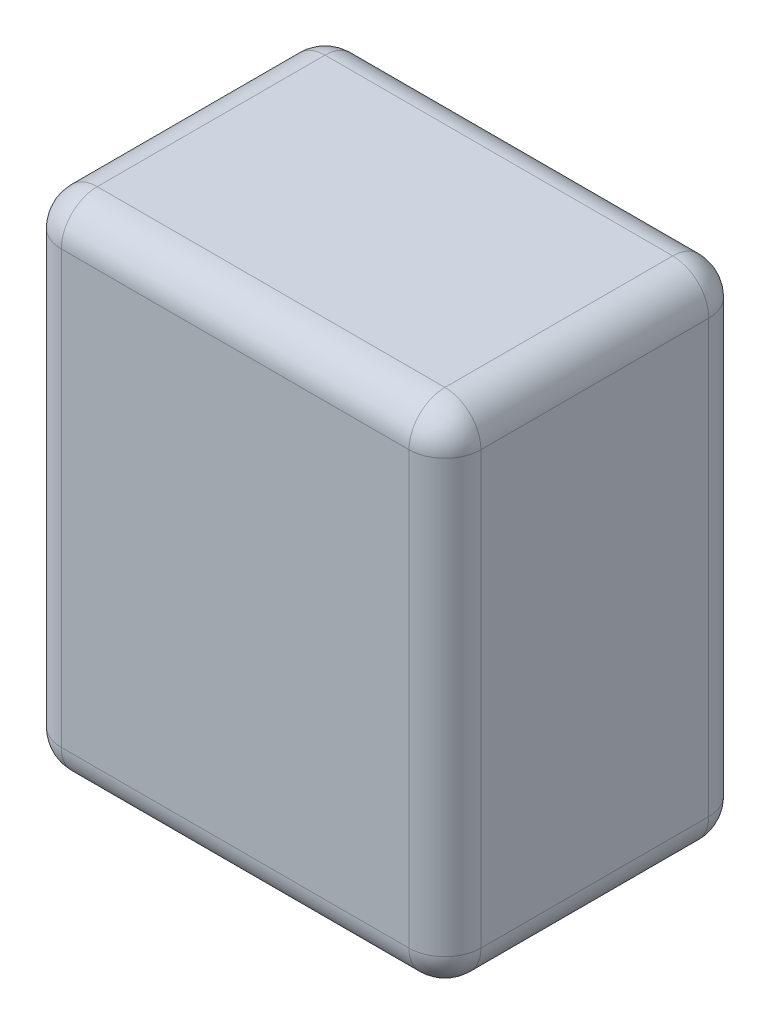
ISO-10303-21;
HEADER;
FILE_DESCRIPTION(('STEP AP214'),'2;1');
FILE_NAME('part.step','',(''),(''),'','','');
FILE_SCHEMA(('AUTOMOTIVE_DESIGN { 1 0 10303 214 1 1 1 1 }'));
ENDSEC;
DATA;
#1=APPLICATION_CONTEXT('core data for automotive mechanical design processes');
#2=APPLICATION_PROTOCOL_DEFINITION('international standard','automotive_design',2000,#1);
#3=PRODUCT_CONTEXT('',#1,'mechanical');
#4=PRODUCT('Part','Part','',(#3));
#5=PRODUCT_RELATED_PRODUCT_CATEGORY('part','',(#4));
#6=PRODUCT_DEFINITION_FORMATION('','',#4);
#7=PRODUCT_DEFINITION_CONTEXT('part definition',#1,'design');
#8=PRODUCT_DEFINITION('design','',#6,#7);
#9=PRODUCT_DEFINITION_SHAPE('','',#8);
#10=(LENGTH_UNIT() NAMED_UNIT(*) SI_UNIT(.MILLI.,.METRE.));
#11=(NAMED_UNIT(*) PLANE_ANGLE_UNIT() SI_UNIT($,.RADIAN.));
#12=(NAMED_UNIT(*) SI_UNIT($,.STERADIAN.) SOLID_ANGLE_UNIT());
#13=UNCERTAINTY_MEASURE_WITH_UNIT(LENGTH_MEASURE(1.E-05),#10,'distance_accuracy_value','');
#14=(GEOMETRIC_REPRESENTATION_CONTEXT(3) GLOBAL_UNCERTAINTY_ASSIGNED_CONTEXT((#13)) GLOBAL_UNIT_ASSIGNED_CONTEXT((#10,
#11,#12)) REPRESENTATION_CONTEXT('',''));
#15=CARTESIAN_POINT('',(0.,0.,0.));
#16=DIRECTION('',(0.,0.,1.));
#17=DIRECTION('',(1.,0.,0.));
#18=AXIS2_PLACEMENT_3D('',#15,#16,#17);
#19=CARTESIAN_POINT('',(17.5,42.,-12.5));
#20=DIRECTION('',(-1.,0.,0.));
#21=DIRECTION('',(0.,0.,1.));
#22=AXIS2_PLACEMENT_3D('',#19,#20,#21);
#23=PLANE('',#22);
#24=DIRECTION('',(0.,-1.,0.));
#25=VECTOR('',#24,1.);
#26=CARTESIAN_POINT('',(17.5,42.,-9.5));
#27=LINE('',#26,#25);
#28=CARTESIAN_POINT('',(17.5,3.,-9.5));
#29=VERTEX_POINT('',#28);
#30=CARTESIAN_POINT('',(17.5,39.,-9.5));
#31=VERTEX_POINT('',#30);
#32=EDGE_CURVE('E139',#29,#31,#27,.F.);
#33=ORIENTED_EDGE('',*,*,#32,.T.);
#34=DIRECTION('',(0.,0.,-1.));
#35=VECTOR('',#34,1.);
#36=CARTESIAN_POINT('',(17.5,39.,12.5));
#37=LINE('',#36,#35);
#38=CARTESIAN_POINT('',(17.5,39.,9.5));
#39=VERTEX_POINT('',#38);
#40=EDGE_CURVE('E185',#31,#39,#37,.F.);
#41=ORIENTED_EDGE('',*,*,#40,.T.);
#42=DIRECTION('',(0.,-1.,0.));
#43=VECTOR('',#42,1.);
#44=CARTESIAN_POINT('',(17.5,42.,9.5));
#45=LINE('',#44,#43);
#46=CARTESIAN_POINT('',(17.5,3.,9.5));
#47=VERTEX_POINT('',#46);
#48=EDGE_CURVE('E180',#39,#47,#45,.T.);
#49=ORIENTED_EDGE('',*,*,#48,.T.);
#50=DIRECTION('',(0.,0.,-1.));
#51=VECTOR('',#50,1.);
#52=CARTESIAN_POINT('',(17.5,3.,-12.5));
#53=LINE('',#52,#51);
#54=EDGE_CURVE('E174',#47,#29,#53,.T.);
#55=ORIENTED_EDGE('',*,*,#54,.T.);
#56=EDGE_LOOP('',(#33,#41,#49,#55));
#57=FACE_BOUND('',#56,.T.);
#58=ADVANCED_FACE('F43',(#57),#23,.F.);
#59=CARTESIAN_POINT('',(-17.5,42.,-12.5));
#60=DIRECTION('',(0.,0.,1.));
#61=DIRECTION('',(1.,0.,0.));
#62=AXIS2_PLACEMENT_3D('',#59,#60,#61);
#63=PLANE('',#62);
#64=DIRECTION('',(0.,-1.,0.));
#65=VECTOR('',#64,1.);
#66=CARTESIAN_POINT('',(-14.5,42.,-12.5));
#67=LINE('',#66,#65);
#68=CARTESIAN_POINT('',(-14.5,3.,-12.5));
#69=VERTEX_POINT('',#68);
#70=CARTESIAN_POINT('',(-14.5,39.,-12.5));
#71=VERTEX_POINT('',#70);
#72=EDGE_CURVE('E164',#69,#71,#67,.F.);
#73=ORIENTED_EDGE('',*,*,#72,.T.);
#74=DIRECTION('',(-1.,0.,0.));
#75=VECTOR('',#74,1.);
#76=CARTESIAN_POINT('',(17.5,39.,-12.5));
#77=LINE('',#76,#75);
#78=CARTESIAN_POINT('',(14.5,39.,-12.5));
#79=VERTEX_POINT('',#78);
#80=EDGE_CURVE('E168',#71,#79,#77,.F.);
#81=ORIENTED_EDGE('',*,*,#80,.T.);
#82=DIRECTION('',(0.,-1.,0.));
#83=VECTOR('',#82,1.);
#84=CARTESIAN_POINT('',(14.5,42.,-12.5));
#85=LINE('',#84,#83);
#86=CARTESIAN_POINT('',(14.5,3.,-12.5));
#87=VERTEX_POINT('',#86);
#88=EDGE_CURVE('E137',#79,#87,#85,.T.);
#89=ORIENTED_EDGE('',*,*,#88,.T.);
#90=DIRECTION('',(-1.,0.,0.));
#91=VECTOR('',#90,1.);
#92=CARTESIAN_POINT('',(-17.5,3.,-12.5));
#93=LINE('',#92,#91);
#94=EDGE_CURVE('E157',#87,#69,#93,.T.);
#95=ORIENTED_EDGE('',*,*,#94,.T.);
#96=EDGE_LOOP('',(#73,#81,#89,#95));
#97=FACE_BOUND('',#96,.T.);
#98=ADVANCED_FACE('F166',(#97),#63,.F.);
#99=CARTESIAN_POINT('',(-17.5,42.,-12.5));
#100=DIRECTION('',(1.,0.,0.));
#101=DIRECTION('',(0.,0.,-1.));
#102=AXIS2_PLACEMENT_3D('',#99,#100,#101);
#103=PLANE('',#102);
#104=DIRECTION('',(0.,-1.,0.));
#105=VECTOR('',#104,1.);
#106=CARTESIAN_POINT('',(-17.5,42.,9.5));
#107=LINE('',#106,#105);
#108=CARTESIAN_POINT('',(-17.5,3.,9.5));
#109=VERTEX_POINT('',#108);
#110=CARTESIAN_POINT('',(-17.5,39.,9.5));
#111=VERTEX_POINT('',#110);
#112=EDGE_CURVE('E191',#109,#111,#107,.F.);
#113=ORIENTED_EDGE('',*,*,#112,.T.);
#114=DIRECTION('',(0.,0.,1.));
#115=VECTOR('',#114,1.);
#116=CARTESIAN_POINT('',(-17.5,39.,-12.5));
#117=LINE('',#116,#115);
#118=CARTESIAN_POINT('',(-17.5,39.,-9.5));
#119=VERTEX_POINT('',#118);
#120=EDGE_CURVE('E198',#111,#119,#117,.F.);
#121=ORIENTED_EDGE('',*,*,#120,.T.);
#122=DIRECTION('',(0.,-1.,0.));
#123=VECTOR('',#122,1.);
#124=CARTESIAN_POINT('',(-17.5,42.,-9.5));
#125=LINE('',#124,#123);
#126=CARTESIAN_POINT('',(-17.5,3.,-9.5));
#127=VERTEX_POINT('',#126);
#128=EDGE_CURVE('E194',#119,#127,#125,.T.);
#129=ORIENTED_EDGE('',*,*,#128,.T.);
#130=DIRECTION('',(0.,0.,1.));
#131=VECTOR('',#130,1.);
#132=CARTESIAN_POINT('',(-17.5,3.,-12.5));
#133=LINE('',#132,#131);
#134=EDGE_CURVE('E188',#127,#109,#133,.T.);
#135=ORIENTED_EDGE('',*,*,#134,.T.);
#136=EDGE_LOOP('',(#113,#121,#129,#135));
#137=FACE_BOUND('',#136,.T.);
#138=ADVANCED_FACE('F337',(#137),#103,.F.);
#139=CARTESIAN_POINT('',(-17.5,42.,12.5));
#140=DIRECTION('',(0.,0.,-1.));
#141=DIRECTION('',(-1.,0.,0.));
#142=AXIS2_PLACEMENT_3D('',#139,#140,#141);
#143=PLANE('',#142);
#144=DIRECTION('',(0.,-1.,0.));
#145=VECTOR('',#144,1.);
#146=CARTESIAN_POINT('',(14.5,42.,12.5));
#147=LINE('',#146,#145);
#148=CARTESIAN_POINT('',(14.5,3.,12.5));
#149=VERTEX_POINT('',#148);
#150=CARTESIAN_POINT('',(14.5,39.,12.5));
#151=VERTEX_POINT('',#150);
#152=EDGE_CURVE('E204',#149,#151,#147,.F.);
#153=ORIENTED_EDGE('',*,*,#152,.T.);
#154=DIRECTION('',(1.,0.,0.));
#155=VECTOR('',#154,1.);
#156=CARTESIAN_POINT('',(-17.5,39.,12.5));
#157=LINE('',#156,#155);
#158=CARTESIAN_POINT('',(-14.5,39.,12.5));
#159=VERTEX_POINT('',#158);
#160=EDGE_CURVE('E211',#151,#159,#157,.F.);
#161=ORIENTED_EDGE('',*,*,#160,.T.);
#162=DIRECTION('',(0.,-1.,0.));
#163=VECTOR('',#162,1.);
#164=CARTESIAN_POINT('',(-14.5,42.,12.5));
#165=LINE('',#164,#163);
#166=CARTESIAN_POINT('',(-14.5,3.,12.5));
#167=VERTEX_POINT('',#166);
#168=EDGE_CURVE('E207',#159,#167,#165,.T.);
#169=ORIENTED_EDGE('',*,*,#168,.T.);
#170=DIRECTION('',(1.,0.,0.));
#171=VECTOR('',#170,1.);
#172=CARTESIAN_POINT('',(-17.5,3.,12.5));
#173=LINE('',#172,#171);
#174=EDGE_CURVE('E201',#167,#149,#173,.T.);
#175=ORIENTED_EDGE('',*,*,#174,.T.);
#176=EDGE_LOOP('',(#153,#161,#169,#175));
#177=FACE_BOUND('',#176,.T.);
#178=ADVANCED_FACE('F347',(#177),#143,.F.);
#179=CARTESIAN_POINT('',(0.,42.,0.));
#180=DIRECTION('',(0.,1.,0.));
#181=DIRECTION('',(0.,0.,1.));
#182=AXIS2_PLACEMENT_3D('',#179,#180,#181);
#183=PLANE('',#182);
#184=DIRECTION('',(0.,0.,1.));
#185=VECTOR('',#184,1.);
#186=CARTESIAN_POINT('',(-14.5,42.,12.5));
#187=LINE('',#186,#185);
#188=CARTESIAN_POINT('',(-14.5,42.,-9.5));
#189=VERTEX_POINT('',#188);
#190=CARTESIAN_POINT('',(-14.5,42.,9.5));
#191=VERTEX_POINT('',#190);
#192=EDGE_CURVE('E220',#189,#191,#187,.T.);
#193=ORIENTED_EDGE('',*,*,#192,.T.);
#194=DIRECTION('',(1.,0.,0.));
#195=VECTOR('',#194,1.);
#196=CARTESIAN_POINT('',(17.5,42.,9.5));
#197=LINE('',#196,#195);
#198=CARTESIAN_POINT('',(14.5,42.,9.5));
#199=VERTEX_POINT('',#198);
#200=EDGE_CURVE('E223',#191,#199,#197,.T.);
#201=ORIENTED_EDGE('',*,*,#200,.T.);
#202=DIRECTION('',(0.,0.,-1.));
#203=VECTOR('',#202,1.);
#204=CARTESIAN_POINT('',(14.5,42.,-12.5));
#205=LINE('',#204,#203);
#206=CARTESIAN_POINT('',(14.5,42.,-9.5));
#207=VERTEX_POINT('',#206);
#208=EDGE_CURVE('E214',#199,#207,#205,.T.);
#209=ORIENTED_EDGE('',*,*,#208,.T.);
#210=DIRECTION('',(-1.,0.,0.));
#211=VECTOR('',#210,1.);
#212=CARTESIAN_POINT('',(-17.5,42.,-9.5));
#213=LINE('',#212,#211);
#214=EDGE_CURVE('E217',#207,#189,#213,.T.);
#215=ORIENTED_EDGE('',*,*,#214,.T.);
#216=EDGE_LOOP('',(#193,#201,#209,#215));
#217=FACE_BOUND('',#216,.T.);
#218=ADVANCED_FACE('F329',(#217),#183,.T.);
#219=CARTESIAN_POINT('',(0.,0.,0.));
#220=DIRECTION('',(0.,1.,0.));
#221=DIRECTION('',(0.,0.,1.));
#222=AXIS2_PLACEMENT_3D('',#219,#220,#221);
#223=PLANE('',#222);
#224=DIRECTION('',(0.,0.,-1.));
#225=VECTOR('',#224,1.);
#226=CARTESIAN_POINT('',(14.5,0.,0.));
#227=LINE('',#226,#225);
#228=CARTESIAN_POINT('',(14.5,0.,-9.5));
#229=VERTEX_POINT('',#228);
#230=CARTESIAN_POINT('',(14.5,0.,9.5));
#231=VERTEX_POINT('',#230);
#232=EDGE_CURVE('E227',#229,#231,#227,.F.);
#233=ORIENTED_EDGE('',*,*,#232,.T.);
#234=DIRECTION('',(1.,0.,0.));
#235=VECTOR('',#234,1.);
#236=CARTESIAN_POINT('',(0.,0.,9.5));
#237=LINE('',#236,#235);
#238=CARTESIAN_POINT('',(-14.5,0.,9.5));
#239=VERTEX_POINT('',#238);
#240=EDGE_CURVE('E11',#231,#239,#237,.F.);
#241=ORIENTED_EDGE('',*,*,#240,.T.);
#242=DIRECTION('',(0.,0.,1.));
#243=VECTOR('',#242,1.);
#244=CARTESIAN_POINT('',(-14.5,0.,0.));
#245=LINE('',#244,#243);
#246=CARTESIAN_POINT('',(-14.5,0.,-9.5));
#247=VERTEX_POINT('',#246);
#248=EDGE_CURVE('E53',#239,#247,#245,.F.);
#249=ORIENTED_EDGE('',*,*,#248,.T.);
#250=DIRECTION('',(-1.,0.,0.));
#251=VECTOR('',#250,1.);
#252=CARTESIAN_POINT('',(0.,0.,-9.5));
#253=LINE('',#252,#251);
#254=EDGE_CURVE('E230',#247,#229,#253,.F.);
#255=ORIENTED_EDGE('',*,*,#254,.T.);
#256=EDGE_LOOP('',(#233,#241,#249,#255));
#257=FACE_BOUND('',#256,.T.);
#258=ADVANCED_FACE('F575',(#257),#223,.F.);
#259=CARTESIAN_POINT('',(-14.5,42.,9.5));
#260=DIRECTION('',(0.,-1.,0.));
#261=DIRECTION('',(0.,0.,-1.));
#262=AXIS2_PLACEMENT_3D('',#259,#260,#261);
#263=CYLINDRICAL_SURFACE('',#262,3.);
#264=CARTESIAN_POINT('',(-14.5,39.,9.5));
#265=DIRECTION('',(0.,1.,0.));
#266=DIRECTION('',(0.,0.,1.));
#267=AXIS2_PLACEMENT_3D('',#264,#265,#266);
#268=CIRCLE('',#267,3.);
#269=EDGE_CURVE('E47',#111,#159,#268,.T.);
#270=ORIENTED_EDGE('',*,*,#269,.F.);
#271=ORIENTED_EDGE('',*,*,#112,.F.);
#272=CARTESIAN_POINT('',(-14.5,3.,9.5));
#273=DIRECTION('',(0.,-1.,0.));
#274=DIRECTION('',(0.,0.,-1.));
#275=AXIS2_PLACEMENT_3D('',#272,#273,#274);
#276=CIRCLE('',#275,3.);
#277=EDGE_CURVE('E305',#167,#109,#276,.T.);
#278=ORIENTED_EDGE('',*,*,#277,.F.);
#279=ORIENTED_EDGE('',*,*,#168,.F.);
#280=EDGE_LOOP('',(#270,#271,#278,#279));
#281=FACE_BOUND('',#280,.T.);
#282=ADVANCED_FACE('F45',(#281),#263,.T.);
#283=CARTESIAN_POINT('',(-14.5,39.,9.5));
#284=DIRECTION('',(0.,0.,1.));
#285=DIRECTION('',(1.,0.,0.));
#286=AXIS2_PLACEMENT_3D('',#283,#284,#285);
#287=SPHERICAL_SURFACE('',#286,3.);
#288=CARTESIAN_POINT('',(-14.5,39.,9.5));
#289=DIRECTION('',(0.,0.,1.));
#290=DIRECTION('',(1.,0.,0.));
#291=AXIS2_PLACEMENT_3D('',#288,#289,#290);
#292=CIRCLE('',#291,3.);
#293=EDGE_CURVE('E298',#111,#191,#292,.F.);
#294=ORIENTED_EDGE('',*,*,#293,.F.);
#295=ORIENTED_EDGE('',*,*,#269,.T.);
#296=CARTESIAN_POINT('',(-14.5,39.,9.5));
#297=DIRECTION('',(-1.,0.,0.));
#298=DIRECTION('',(0.,0.,1.));
#299=AXIS2_PLACEMENT_3D('',#296,#297,#298);
#300=CIRCLE('',#299,3.);
#301=EDGE_CURVE('E302',#191,#159,#300,.F.);
#302=ORIENTED_EDGE('',*,*,#301,.F.);
#303=EDGE_LOOP('',(#294,#295,#302));
#304=FACE_BOUND('',#303,.T.);
#305=ADVANCED_FACE('F317',(#304),#287,.T.);
#306=CARTESIAN_POINT('',(-14.5,3.,9.5));
#307=DIRECTION('',(-1.,0.,0.));
#308=DIRECTION('',(0.,-1.,0.));
#309=AXIS2_PLACEMENT_3D('',#306,#307,#308);
#310=SPHERICAL_SURFACE('',#309,3.);
#311=CARTESIAN_POINT('',(-14.5,3.,9.5));
#312=DIRECTION('',(-1.,0.,0.));
#313=DIRECTION('',(0.,0.,1.));
#314=AXIS2_PLACEMENT_3D('',#311,#312,#313);
#315=CIRCLE('',#314,3.);
#316=EDGE_CURVE('E291',#167,#239,#315,.F.);
#317=ORIENTED_EDGE('',*,*,#316,.F.);
#318=ORIENTED_EDGE('',*,*,#277,.T.);
#319=CARTESIAN_POINT('',(-14.5,3.,9.5));
#320=DIRECTION('',(0.,0.,1.));
#321=DIRECTION('',(1.,0.,0.));
#322=AXIS2_PLACEMENT_3D('',#319,#320,#321);
#323=CIRCLE('',#322,3.);
#324=EDGE_CURVE('E295',#239,#109,#323,.F.);
#325=ORIENTED_EDGE('',*,*,#324,.F.);
#326=EDGE_LOOP('',(#317,#318,#325));
#327=FACE_BOUND('',#326,.T.);
#328=ADVANCED_FACE('F548',(#327),#310,.T.);
#329=CARTESIAN_POINT('',(0.,39.,9.5));
#330=DIRECTION('',(-1.,0.,0.));
#331=DIRECTION('',(0.,0.,1.));
#332=AXIS2_PLACEMENT_3D('',#329,#330,#331);
#333=CYLINDRICAL_SURFACE('',#332,3.);
#334=ORIENTED_EDGE('',*,*,#301,.T.);
#335=ORIENTED_EDGE('',*,*,#160,.F.);
#336=CARTESIAN_POINT('',(14.5,39.,9.5));
#337=DIRECTION('',(1.,0.,0.));
#338=DIRECTION('',(0.,0.,-1.));
#339=AXIS2_PLACEMENT_3D('',#336,#337,#338);
#340=CIRCLE('',#339,3.);
#341=EDGE_CURVE('E283',#199,#151,#340,.T.);
#342=ORIENTED_EDGE('',*,*,#341,.F.);
#343=ORIENTED_EDGE('',*,*,#200,.F.);
#344=EDGE_LOOP('',(#334,#335,#342,#343));
#345=FACE_BOUND('',#344,.T.);
#346=ADVANCED_FACE('F325',(#345),#333,.T.);
#347=CARTESIAN_POINT('',(-14.5,39.,0.));
#348=DIRECTION('',(0.,0.,-1.));
#349=DIRECTION('',(-1.,0.,0.));
#350=AXIS2_PLACEMENT_3D('',#347,#348,#349);
#351=CYLINDRICAL_SURFACE('',#350,3.);
#352=ORIENTED_EDGE('',*,*,#293,.T.);
#353=ORIENTED_EDGE('',*,*,#192,.F.);
#354=CARTESIAN_POINT('',(-14.5,39.,-9.5));
#355=DIRECTION('',(0.,0.,-1.));
#356=DIRECTION('',(-1.,0.,0.));
#357=AXIS2_PLACEMENT_3D('',#354,#355,#356);
#358=CIRCLE('',#357,3.);
#359=EDGE_CURVE('E279',#119,#189,#358,.T.);
#360=ORIENTED_EDGE('',*,*,#359,.F.);
#361=ORIENTED_EDGE('',*,*,#120,.F.);
#362=EDGE_LOOP('',(#352,#353,#360,#361));
#363=FACE_BOUND('',#362,.T.);
#364=ADVANCED_FACE('F334',(#363),#351,.T.);
#365=CARTESIAN_POINT('',(-14.5,42.,-9.5));
#366=DIRECTION('',(0.,-1.,0.));
#367=DIRECTION('',(0.,0.,-1.));
#368=AXIS2_PLACEMENT_3D('',#365,#366,#367);
#369=CYLINDRICAL_SURFACE('',#368,3.);
#370=CARTESIAN_POINT('',(-14.5,3.,-9.5));
#371=DIRECTION('',(0.,-1.,0.));
#372=DIRECTION('',(0.,0.,-1.));
#373=AXIS2_PLACEMENT_3D('',#370,#371,#372);
#374=CIRCLE('',#373,3.);
#375=EDGE_CURVE('E271',#127,#69,#374,.T.);
#376=ORIENTED_EDGE('',*,*,#375,.F.);
#377=ORIENTED_EDGE('',*,*,#128,.F.);
#378=CARTESIAN_POINT('',(-14.5,39.,-9.49999999999999));
#379=DIRECTION('',(0.,1.,0.));
#380=DIRECTION('',(0.,0.,1.));
#381=AXIS2_PLACEMENT_3D('',#378,#379,#380);
#382=CIRCLE('',#381,3.);
#383=EDGE_CURVE('E275',#71,#119,#382,.T.);
#384=ORIENTED_EDGE('',*,*,#383,.F.);
#385=ORIENTED_EDGE('',*,*,#72,.F.);
#386=EDGE_LOOP('',(#376,#377,#384,#385));
#387=FACE_BOUND('',#386,.T.);
#388=ADVANCED_FACE('F341',(#387),#369,.T.);
#389=CARTESIAN_POINT('',(-14.5,3.,-12.5));
#390=DIRECTION('',(0.,0.,1.));
#391=DIRECTION('',(1.,0.,0.));
#392=AXIS2_PLACEMENT_3D('',#389,#390,#391);
#393=CYLINDRICAL_SURFACE('',#392,3.);
#394=ORIENTED_EDGE('',*,*,#324,.T.);
#395=ORIENTED_EDGE('',*,*,#134,.F.);
#396=CARTESIAN_POINT('',(-14.5,3.,-9.5));
#397=DIRECTION('',(0.,0.,-1.));
#398=DIRECTION('',(-1.,0.,0.));
#399=AXIS2_PLACEMENT_3D('',#396,#397,#398);
#400=CIRCLE('',#399,3.);
#401=EDGE_CURVE('E268',#247,#127,#400,.T.);
#402=ORIENTED_EDGE('',*,*,#401,.F.);
#403=ORIENTED_EDGE('',*,*,#248,.F.);
#404=EDGE_LOOP('',(#394,#395,#402,#403));
#405=FACE_BOUND('',#404,.T.);
#406=ADVANCED_FACE('F345',(#405),#393,.T.);
#407=CARTESIAN_POINT('',(-17.5,3.,9.5));
#408=DIRECTION('',(1.,0.,0.));
#409=DIRECTION('',(0.,0.,-1.));
#410=AXIS2_PLACEMENT_3D('',#407,#408,#409);
#411=CYLINDRICAL_SURFACE('',#410,3.);
#412=ORIENTED_EDGE('',*,*,#316,.T.);
#413=ORIENTED_EDGE('',*,*,#240,.F.);
#414=CARTESIAN_POINT('',(14.5,3.,9.5));
#415=DIRECTION('',(1.,0.,0.));
#416=DIRECTION('',(0.,0.,-1.));
#417=AXIS2_PLACEMENT_3D('',#414,#415,#416);
#418=CIRCLE('',#417,3.);
#419=EDGE_CURVE('E264',#149,#231,#418,.T.);
#420=ORIENTED_EDGE('',*,*,#419,.F.);
#421=ORIENTED_EDGE('',*,*,#174,.F.);
#422=EDGE_LOOP('',(#412,#413,#420,#421));
#423=FACE_BOUND('',#422,.T.);
#424=ADVANCED_FACE('F357',(#423),#411,.T.);
#425=CARTESIAN_POINT('',(14.5,42.,9.5));
#426=DIRECTION('',(0.,-1.,0.));
#427=DIRECTION('',(0.,0.,-1.));
#428=AXIS2_PLACEMENT_3D('',#425,#426,#427);
#429=CYLINDRICAL_SURFACE('',#428,3.);
#430=CARTESIAN_POINT('',(14.5,39.,9.5));
#431=DIRECTION('',(0.,1.,0.));
#432=DIRECTION('',(0.,0.,1.));
#433=AXIS2_PLACEMENT_3D('',#430,#431,#432);
#434=CIRCLE('',#433,3.);
#435=EDGE_CURVE('E287',#151,#39,#434,.T.);
#436=ORIENTED_EDGE('',*,*,#435,.F.);
#437=ORIENTED_EDGE('',*,*,#152,.F.);
#438=CARTESIAN_POINT('',(14.5,3.,9.5));
#439=DIRECTION('',(0.,-1.,0.));
#440=DIRECTION('',(0.,0.,-1.));
#441=AXIS2_PLACEMENT_3D('',#438,#439,#440);
#442=CIRCLE('',#441,3.);
#443=EDGE_CURVE('E260',#47,#149,#442,.T.);
#444=ORIENTED_EDGE('',*,*,#443,.F.);
#445=ORIENTED_EDGE('',*,*,#48,.F.);
#446=EDGE_LOOP('',(#436,#437,#444,#445));
#447=FACE_BOUND('',#446,.T.);
#448=ADVANCED_FACE('F352',(#447),#429,.T.);
#449=CARTESIAN_POINT('',(14.5,39.,9.5));
#450=DIRECTION('',(0.,0.,1.));
#451=DIRECTION('',(1.,0.,0.));
#452=AXIS2_PLACEMENT_3D('',#449,#450,#451);
#453=SPHERICAL_SURFACE('',#452,3.);
#454=ORIENTED_EDGE('',*,*,#341,.T.);
#455=ORIENTED_EDGE('',*,*,#435,.T.);
#456=CARTESIAN_POINT('',(14.5,39.,9.5));
#457=DIRECTION('',(0.,0.,1.));
#458=DIRECTION('',(1.,0.,0.));
#459=AXIS2_PLACEMENT_3D('',#456,#457,#458);
#460=CIRCLE('',#459,3.);
#461=EDGE_CURVE('E256',#199,#39,#460,.F.);
#462=ORIENTED_EDGE('',*,*,#461,.F.);
#463=EDGE_LOOP('',(#454,#455,#462));
#464=FACE_BOUND('',#463,.T.);
#465=ADVANCED_FACE('F368',(#464),#453,.T.);
#466=CARTESIAN_POINT('',(-14.5,39.,-9.5));
#467=DIRECTION('',(-1.,0.,0.));
#468=DIRECTION('',(0.,0.,1.));
#469=AXIS2_PLACEMENT_3D('',#466,#467,#468);
#470=SPHERICAL_SURFACE('',#469,3.);
#471=ORIENTED_EDGE('',*,*,#383,.T.);
#472=ORIENTED_EDGE('',*,*,#359,.T.);
#473=CARTESIAN_POINT('',(-14.5,39.,-9.5));
#474=DIRECTION('',(-1.,0.,0.));
#475=DIRECTION('',(0.,0.,1.));
#476=AXIS2_PLACEMENT_3D('',#473,#474,#475);
#477=CIRCLE('',#476,3.);
#478=EDGE_CURVE('E252',#71,#189,#477,.F.);
#479=ORIENTED_EDGE('',*,*,#478,.F.);
#480=EDGE_LOOP('',(#471,#472,#479));
#481=FACE_BOUND('',#480,.T.);
#482=ADVANCED_FACE('F378',(#481),#470,.T.);
#483=CARTESIAN_POINT('',(-14.5,3.,-9.5));
#484=DIRECTION('',(-1.,0.,0.));
#485=DIRECTION('',(0.,-1.,0.));
#486=AXIS2_PLACEMENT_3D('',#483,#484,#485);
#487=SPHERICAL_SURFACE('',#486,3.);
#488=ORIENTED_EDGE('',*,*,#401,.T.);
#489=ORIENTED_EDGE('',*,*,#375,.T.);
#490=CARTESIAN_POINT('',(-14.5,3.,-9.49999999999999));
#491=DIRECTION('',(-1.,0.,0.));
#492=DIRECTION('',(0.,0.,1.));
#493=AXIS2_PLACEMENT_3D('',#490,#491,#492);
#494=CIRCLE('',#493,3.);
#495=EDGE_CURVE('E160',#247,#69,#494,.F.);
#496=ORIENTED_EDGE('',*,*,#495,.F.);
#497=EDGE_LOOP('',(#488,#489,#496));
#498=FACE_BOUND('',#497,.T.);
#499=ADVANCED_FACE('F380',(#498),#487,.T.);
#500=CARTESIAN_POINT('',(14.5,3.,9.5));
#501=DIRECTION('',(0.,0.,1.));
#502=DIRECTION('',(0.,-1.,0.));
#503=AXIS2_PLACEMENT_3D('',#500,#501,#502);
#504=SPHERICAL_SURFACE('',#503,3.);
#505=ORIENTED_EDGE('',*,*,#443,.T.);
#506=ORIENTED_EDGE('',*,*,#419,.T.);
#507=CARTESIAN_POINT('',(14.5,3.,9.5));
#508=DIRECTION('',(0.,0.,1.));
#509=DIRECTION('',(1.,0.,0.));
#510=AXIS2_PLACEMENT_3D('',#507,#508,#509);
#511=CIRCLE('',#510,3.);
#512=EDGE_CURVE('E246',#47,#231,#511,.F.);
#513=ORIENTED_EDGE('',*,*,#512,.F.);
#514=EDGE_LOOP('',(#505,#506,#513));
#515=FACE_BOUND('',#514,.T.);
#516=ADVANCED_FACE('F359',(#515),#504,.T.);
#517=CARTESIAN_POINT('',(14.5,39.,0.));
#518=DIRECTION('',(0.,0.,1.));
#519=DIRECTION('',(1.,0.,0.));
#520=AXIS2_PLACEMENT_3D('',#517,#518,#519);
#521=CYLINDRICAL_SURFACE('',#520,3.);
#522=ORIENTED_EDGE('',*,*,#461,.T.);
#523=ORIENTED_EDGE('',*,*,#40,.F.);
#524=CARTESIAN_POINT('',(14.5,39.,-9.5));
#525=DIRECTION('',(0.,0.,-1.));
#526=DIRECTION('',(-1.,0.,0.));
#527=AXIS2_PLACEMENT_3D('',#524,#525,#526);
#528=CIRCLE('',#527,3.);
#529=EDGE_CURVE('E242',#207,#31,#528,.T.);
#530=ORIENTED_EDGE('',*,*,#529,.F.);
#531=ORIENTED_EDGE('',*,*,#208,.F.);
#532=EDGE_LOOP('',(#522,#523,#530,#531));
#533=FACE_BOUND('',#532,.T.);
#534=ADVANCED_FACE('F370',(#533),#521,.T.);
#535=CARTESIAN_POINT('',(0.,39.,-9.5));
#536=DIRECTION('',(1.,0.,0.));
#537=DIRECTION('',(0.,0.,-1.));
#538=AXIS2_PLACEMENT_3D('',#535,#536,#537);
#539=CYLINDRICAL_SURFACE('',#538,3.);
#540=ORIENTED_EDGE('',*,*,#478,.T.);
#541=ORIENTED_EDGE('',*,*,#214,.F.);
#542=CARTESIAN_POINT('',(14.5,39.,-9.49999999999999));
#543=DIRECTION('',(1.,0.,0.));
#544=DIRECTION('',(0.,1.,0.));
#545=AXIS2_PLACEMENT_3D('',#542,#543,#544);
#546=CIRCLE('',#545,3.);
#547=EDGE_CURVE('E154',#79,#207,#546,.T.);
#548=ORIENTED_EDGE('',*,*,#547,.F.);
#549=ORIENTED_EDGE('',*,*,#80,.F.);
#550=EDGE_LOOP('',(#540,#541,#548,#549));
#551=FACE_BOUND('',#550,.T.);
#552=ADVANCED_FACE('F376',(#551),#539,.T.);
#553=CARTESIAN_POINT('',(-17.5,3.,-9.5));
#554=DIRECTION('',(-1.,0.,0.));
#555=DIRECTION('',(0.,0.,1.));
#556=AXIS2_PLACEMENT_3D('',#553,#554,#555);
#557=CYLINDRICAL_SURFACE('',#556,3.);
#558=ORIENTED_EDGE('',*,*,#495,.T.);
#559=ORIENTED_EDGE('',*,*,#94,.F.);
#560=CARTESIAN_POINT('',(14.5,3.,-9.5));
#561=DIRECTION('',(1.,0.,0.));
#562=DIRECTION('',(0.,0.,-1.));
#563=AXIS2_PLACEMENT_3D('',#560,#561,#562);
#564=CIRCLE('',#563,3.);
#565=EDGE_CURVE('E146',#229,#87,#564,.T.);
#566=ORIENTED_EDGE('',*,*,#565,.F.);
#567=ORIENTED_EDGE('',*,*,#254,.F.);
#568=EDGE_LOOP('',(#558,#559,#566,#567));
#569=FACE_BOUND('',#568,.T.);
#570=ADVANCED_FACE('F158',(#569),#557,.T.);
#571=CARTESIAN_POINT('',(14.5,3.,-12.5));
#572=DIRECTION('',(0.,0.,-1.));
#573=DIRECTION('',(-1.,0.,0.));
#574=AXIS2_PLACEMENT_3D('',#571,#572,#573);
#575=CYLINDRICAL_SURFACE('',#574,3.);
#576=ORIENTED_EDGE('',*,*,#512,.T.);
#577=ORIENTED_EDGE('',*,*,#232,.F.);
#578=CARTESIAN_POINT('',(14.5,3.,-9.5));
#579=DIRECTION('',(0.,0.,-1.));
#580=DIRECTION('',(-1.,0.,0.));
#581=AXIS2_PLACEMENT_3D('',#578,#579,#580);
#582=CIRCLE('',#581,3.);
#583=EDGE_CURVE('E150',#29,#229,#582,.T.);
#584=ORIENTED_EDGE('',*,*,#583,.F.);
#585=ORIENTED_EDGE('',*,*,#54,.F.);
#586=EDGE_LOOP('',(#576,#577,#584,#585));
#587=FACE_BOUND('',#586,.T.);
#588=ADVANCED_FACE('F363',(#587),#575,.T.);
#589=CARTESIAN_POINT('',(14.5,39.,-9.5));
#590=DIRECTION('',(0.,1.,0.));
#591=DIRECTION('',(0.,0.,1.));
#592=AXIS2_PLACEMENT_3D('',#589,#590,#591);
#593=SPHERICAL_SURFACE('',#592,3.);
#594=ORIENTED_EDGE('',*,*,#547,.T.);
#595=ORIENTED_EDGE('',*,*,#529,.T.);
#596=CARTESIAN_POINT('',(14.5,39.,-9.5));
#597=DIRECTION('',(0.,1.,0.));
#598=DIRECTION('',(0.,0.,1.));
#599=AXIS2_PLACEMENT_3D('',#596,#597,#598);
#600=CIRCLE('',#599,3.);
#601=EDGE_CURVE('E143',#79,#31,#600,.F.);
#602=ORIENTED_EDGE('',*,*,#601,.F.);
#603=EDGE_LOOP('',(#594,#595,#602));
#604=FACE_BOUND('',#603,.T.);
#605=ADVANCED_FACE('F374',(#604),#593,.T.);
#606=CARTESIAN_POINT('',(14.5,3.,-9.5));
#607=DIRECTION('',(0.,-1.,0.));
#608=DIRECTION('',(0.,0.,-1.));
#609=AXIS2_PLACEMENT_3D('',#606,#607,#608);
#610=SPHERICAL_SURFACE('',#609,3.);
#611=ORIENTED_EDGE('',*,*,#583,.T.);
#612=ORIENTED_EDGE('',*,*,#565,.T.);
#613=CARTESIAN_POINT('',(14.5,3.,-9.49999999999999));
#614=DIRECTION('',(0.,-1.,0.));
#615=DIRECTION('',(0.,0.,-1.));
#616=AXIS2_PLACEMENT_3D('',#613,#614,#615);
#617=CIRCLE('',#616,3.);
#618=EDGE_CURVE('E133',#29,#87,#617,.F.);
#619=ORIENTED_EDGE('',*,*,#618,.F.);
#620=EDGE_LOOP('',(#611,#612,#619));
#621=FACE_BOUND('',#620,.T.);
#622=ADVANCED_FACE('F148',(#621),#610,.T.);
#623=CARTESIAN_POINT('',(14.5,42.,-9.5));
#624=DIRECTION('',(0.,-1.,0.));
#625=DIRECTION('',(0.,0.,-1.));
#626=AXIS2_PLACEMENT_3D('',#623,#624,#625);
#627=CYLINDRICAL_SURFACE('',#626,3.);
#628=ORIENTED_EDGE('',*,*,#601,.T.);
#629=ORIENTED_EDGE('',*,*,#32,.F.);
#630=ORIENTED_EDGE('',*,*,#618,.T.);
#631=ORIENTED_EDGE('',*,*,#88,.F.);
#632=EDGE_LOOP('',(#628,#629,#630,#631));
#633=FACE_BOUND('',#632,.T.);
#634=ADVANCED_FACE('F135',(#633),#627,.T.);
#635=CLOSED_SHELL('',(#58,#98,#138,#178,#218,#258,#282,#305,#328,#346,#364,#388,#406,#424,#448,
#465,#482,#499,#516,#534,#552,#570,#588,#605,#622,#634));
#636=MANIFOLD_SOLID_BREP('B2',#635);
#637=ADVANCED_BREP_SHAPE_REPRESENTATION('',(#18,#636),#14);
#638=SHAPE_DEFINITION_REPRESENTATION(#9,#637);
ENDSEC;
END-ISO-10303-21;
